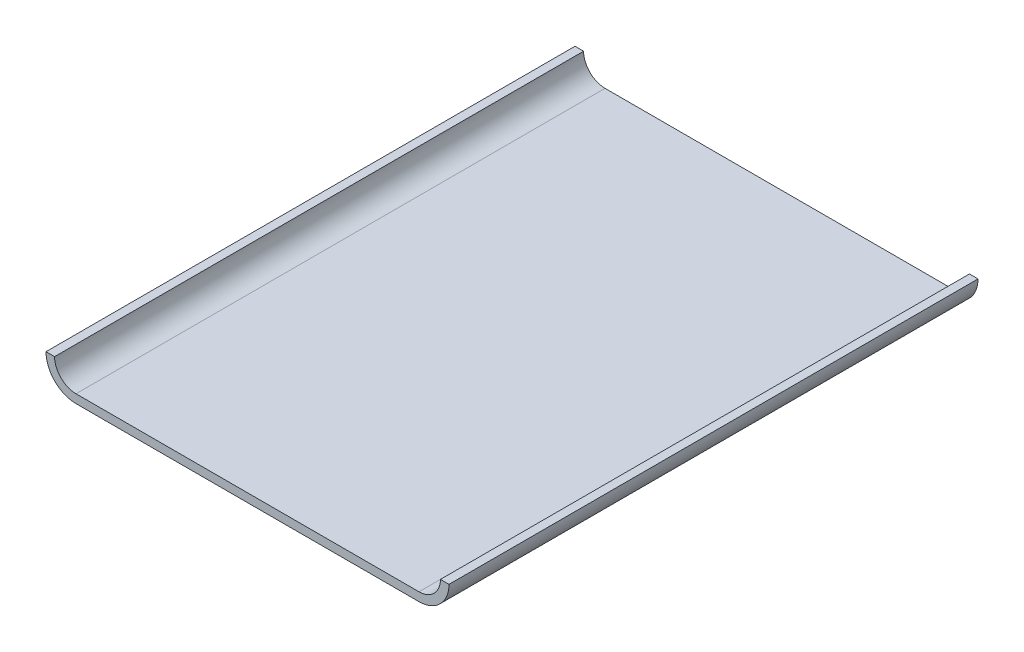
ISO-10303-21;
HEADER;
FILE_DESCRIPTION(('STEP AP214'),'2;1');
FILE_NAME('part.step','',(''),(''),'','','');
FILE_SCHEMA(('AUTOMOTIVE_DESIGN { 1 0 10303 214 1 1 1 1 }'));
ENDSEC;
DATA;
#1=APPLICATION_CONTEXT('core data for automotive mechanical design processes');
#2=APPLICATION_PROTOCOL_DEFINITION('international standard','automotive_design',2000,#1);
#3=PRODUCT_CONTEXT('',#1,'mechanical');
#4=PRODUCT('Part','Part','',(#3));
#5=PRODUCT_RELATED_PRODUCT_CATEGORY('part','',(#4));
#6=PRODUCT_DEFINITION_FORMATION('','',#4);
#7=PRODUCT_DEFINITION_CONTEXT('part definition',#1,'design');
#8=PRODUCT_DEFINITION('design','',#6,#7);
#9=PRODUCT_DEFINITION_SHAPE('','',#8);
#10=(LENGTH_UNIT() NAMED_UNIT(*) SI_UNIT(.MILLI.,.METRE.));
#11=(NAMED_UNIT(*) PLANE_ANGLE_UNIT() SI_UNIT($,.RADIAN.));
#12=(NAMED_UNIT(*) SI_UNIT($,.STERADIAN.) SOLID_ANGLE_UNIT());
#13=UNCERTAINTY_MEASURE_WITH_UNIT(LENGTH_MEASURE(1.E-05),#10,'distance_accuracy_value','');
#14=(GEOMETRIC_REPRESENTATION_CONTEXT(3) GLOBAL_UNCERTAINTY_ASSIGNED_CONTEXT((#13)) GLOBAL_UNIT_ASSIGNED_CONTEXT((#10,
#11,#12)) REPRESENTATION_CONTEXT('',''));
#15=CARTESIAN_POINT('',(0.,0.,0.));
#16=DIRECTION('',(0.,0.,1.));
#17=DIRECTION('',(1.,0.,0.));
#18=AXIS2_PLACEMENT_3D('',#15,#16,#17);
#19=CARTESIAN_POINT('',(0.,-77.851,0.));
#20=DIRECTION('',(0.,1.,0.));
#21=DIRECTION('',(0.,0.,1.));
#22=AXIS2_PLACEMENT_3D('',#19,#20,#21);
#23=PLANE('',#22);
#24=DIRECTION('',(0.,0.,-1.));
#25=VECTOR('',#24,1.);
#26=CARTESIAN_POINT('',(119.38,-77.851,156.718));
#27=LINE('',#26,#25);
#28=CARTESIAN_POINT('',(119.38,-77.851,156.718));
#29=VERTEX_POINT('',#28);
#30=CARTESIAN_POINT('',(119.38,-77.851,-156.718));
#31=VERTEX_POINT('',#30);
#32=EDGE_CURVE('E108',#29,#31,#27,.T.);
#33=ORIENTED_EDGE('',*,*,#32,.T.);
#34=DIRECTION('',(-1.,0.,0.));
#35=VECTOR('',#34,1.);
#36=CARTESIAN_POINT('',(101.6,-77.851,-156.718));
#37=LINE('',#36,#35);
#38=CARTESIAN_POINT('',(114.3,-77.851,-156.718));
#39=VERTEX_POINT('',#38);
#40=EDGE_CURVE('E105',#31,#39,#37,.T.);
#41=ORIENTED_EDGE('',*,*,#40,.T.);
#42=DIRECTION('',(0.,0.,-1.));
#43=VECTOR('',#42,1.);
#44=CARTESIAN_POINT('',(114.3,-77.851,156.718));
#45=LINE('',#44,#43);
#46=CARTESIAN_POINT('',(114.3,-77.851,156.718));
#47=VERTEX_POINT('',#46);
#48=EDGE_CURVE('E40',#47,#39,#45,.T.);
#49=ORIENTED_EDGE('',*,*,#48,.F.);
#50=DIRECTION('',(1.,0.,0.));
#51=VECTOR('',#50,1.);
#52=CARTESIAN_POINT('',(114.3,-77.851,156.718));
#53=LINE('',#52,#51);
#54=EDGE_CURVE('E122',#47,#29,#53,.T.);
#55=ORIENTED_EDGE('',*,*,#54,.T.);
#56=EDGE_LOOP('',(#33,#41,#49,#55));
#57=FACE_BOUND('',#56,.T.);
#58=ADVANCED_FACE('F36',(#57),#23,.T.);
#59=DIRECTION('',(0.,0.,-1.));
#60=VECTOR('',#59,1.);
#61=CARTESIAN_POINT('',(-119.38,-77.851,156.718));
#62=LINE('',#61,#60);
#63=CARTESIAN_POINT('',(-119.38,-77.851,156.718));
#64=VERTEX_POINT('',#63);
#65=CARTESIAN_POINT('',(-119.38,-77.851,-156.718));
#66=VERTEX_POINT('',#65);
#67=EDGE_CURVE('E75',#64,#66,#62,.T.);
#68=ORIENTED_EDGE('',*,*,#67,.F.);
#69=DIRECTION('',(1.,0.,0.));
#70=VECTOR('',#69,1.);
#71=CARTESIAN_POINT('',(-119.38,-77.851,156.718));
#72=LINE('',#71,#70);
#73=CARTESIAN_POINT('',(-114.3,-77.851,156.718));
#74=VERTEX_POINT('',#73);
#75=EDGE_CURVE('E124',#64,#74,#72,.T.);
#76=ORIENTED_EDGE('',*,*,#75,.T.);
#77=DIRECTION('',(0.,0.,-1.));
#78=VECTOR('',#77,1.);
#79=CARTESIAN_POINT('',(-114.3,-77.851,156.718));
#80=LINE('',#79,#78);
#81=CARTESIAN_POINT('',(-114.3,-77.851,-156.718));
#82=VERTEX_POINT('',#81);
#83=EDGE_CURVE('E127',#74,#82,#80,.T.);
#84=ORIENTED_EDGE('',*,*,#83,.T.);
#85=EDGE_CURVE('E111',#82,#66,#37,.T.);
#86=ORIENTED_EDGE('',*,*,#85,.T.);
#87=EDGE_LOOP('',(#68,#76,#84,#86));
#88=FACE_BOUND('',#87,.T.);
#89=ADVANCED_FACE('F183',(#88),#23,.T.);
#90=CARTESIAN_POINT('',(101.6,-77.851,-156.718));
#91=DIRECTION('',(0.,0.,1.));
#92=DIRECTION('',(1.,0.,0.));
#93=AXIS2_PLACEMENT_3D('',#90,#91,#92);
#94=PLANE('',#93);
#95=ORIENTED_EDGE('',*,*,#40,.F.);
#96=CARTESIAN_POINT('',(101.6,-77.851,-156.718));
#97=DIRECTION('',(0.,0.,1.));
#98=DIRECTION('',(1.,0.,0.));
#99=AXIS2_PLACEMENT_3D('',#96,#97,#98);
#100=CIRCLE('',#99,17.78);
#101=CARTESIAN_POINT('',(101.6,-95.631,-156.718));
#102=VERTEX_POINT('',#101);
#103=EDGE_CURVE('E148',#102,#31,#100,.T.);
#104=ORIENTED_EDGE('',*,*,#103,.F.);
#105=DIRECTION('',(1.,0.,0.));
#106=VECTOR('',#105,1.);
#107=CARTESIAN_POINT('',(-101.6,-95.631,-156.718));
#108=LINE('',#107,#106);
#109=CARTESIAN_POINT('',(-101.6,-95.631,-156.718));
#110=VERTEX_POINT('',#109);
#111=EDGE_CURVE('E143',#110,#102,#108,.T.);
#112=ORIENTED_EDGE('',*,*,#111,.F.);
#113=CARTESIAN_POINT('',(-101.6,-77.851,-156.718));
#114=DIRECTION('',(0.,0.,1.));
#115=DIRECTION('',(-1.,0.,0.));
#116=AXIS2_PLACEMENT_3D('',#113,#114,#115);
#117=CIRCLE('',#116,17.78);
#118=EDGE_CURVE('E145',#66,#110,#117,.T.);
#119=ORIENTED_EDGE('',*,*,#118,.F.);
#120=ORIENTED_EDGE('',*,*,#85,.F.);
#121=CARTESIAN_POINT('',(-101.6,-77.851,-156.718));
#122=DIRECTION('',(0.,0.,1.));
#123=DIRECTION('',(-1.,0.,0.));
#124=AXIS2_PLACEMENT_3D('',#121,#122,#123);
#125=CIRCLE('',#124,12.7);
#126=CARTESIAN_POINT('',(-101.6,-90.551,-156.718));
#127=VERTEX_POINT('',#126);
#128=EDGE_CURVE('E11',#82,#127,#125,.T.);
#129=ORIENTED_EDGE('',*,*,#128,.T.);
#130=DIRECTION('',(1.,0.,0.));
#131=VECTOR('',#130,1.);
#132=CARTESIAN_POINT('',(-101.6,-90.551,-156.718));
#133=LINE('',#132,#131);
#134=CARTESIAN_POINT('',(101.6,-90.551,-156.718));
#135=VERTEX_POINT('',#134);
#136=EDGE_CURVE('E46',#127,#135,#133,.T.);
#137=ORIENTED_EDGE('',*,*,#136,.T.);
#138=CARTESIAN_POINT('',(101.6,-77.851,-156.718));
#139=DIRECTION('',(0.,0.,1.));
#140=DIRECTION('',(1.,0.,0.));
#141=AXIS2_PLACEMENT_3D('',#138,#139,#140);
#142=CIRCLE('',#141,12.7);
#143=EDGE_CURVE('E95',#135,#39,#142,.T.);
#144=ORIENTED_EDGE('',*,*,#143,.T.);
#145=EDGE_LOOP('',(#95,#104,#112,#119,#120,#129,#137,#144));
#146=FACE_BOUND('',#145,.T.);
#147=ADVANCED_FACE('F38',(#146),#94,.F.);
#148=CARTESIAN_POINT('',(101.6,-77.851,156.718));
#149=DIRECTION('',(0.,0.,1.));
#150=DIRECTION('',(1.,0.,0.));
#151=AXIS2_PLACEMENT_3D('',#148,#149,#150);
#152=PLANE('',#151);
#153=ORIENTED_EDGE('',*,*,#54,.F.);
#154=CARTESIAN_POINT('',(101.6,-77.851,156.718));
#155=DIRECTION('',(0.,0.,1.));
#156=DIRECTION('',(1.,0.,0.));
#157=AXIS2_PLACEMENT_3D('',#154,#155,#156);
#158=CIRCLE('',#157,12.7);
#159=CARTESIAN_POINT('',(101.6,-90.551,156.718));
#160=VERTEX_POINT('',#159);
#161=EDGE_CURVE('E98',#160,#47,#158,.T.);
#162=ORIENTED_EDGE('',*,*,#161,.F.);
#163=DIRECTION('',(1.,0.,0.));
#164=VECTOR('',#163,1.);
#165=CARTESIAN_POINT('',(-101.6,-90.551,156.718));
#166=LINE('',#165,#164);
#167=CARTESIAN_POINT('',(-101.6,-90.551,156.718));
#168=VERTEX_POINT('',#167);
#169=EDGE_CURVE('E66',#168,#160,#166,.T.);
#170=ORIENTED_EDGE('',*,*,#169,.F.);
#171=CARTESIAN_POINT('',(-101.6,-77.851,156.718));
#172=DIRECTION('',(0.,0.,1.));
#173=DIRECTION('',(-1.,0.,0.));
#174=AXIS2_PLACEMENT_3D('',#171,#172,#173);
#175=CIRCLE('',#174,12.7);
#176=EDGE_CURVE('E113',#74,#168,#175,.T.);
#177=ORIENTED_EDGE('',*,*,#176,.F.);
#178=ORIENTED_EDGE('',*,*,#75,.F.);
#179=CARTESIAN_POINT('',(-101.6,-77.851,156.718));
#180=DIRECTION('',(0.,0.,1.));
#181=DIRECTION('',(-1.,0.,0.));
#182=AXIS2_PLACEMENT_3D('',#179,#180,#181);
#183=CIRCLE('',#182,17.78);
#184=CARTESIAN_POINT('',(-101.6,-95.631,156.718));
#185=VERTEX_POINT('',#184);
#186=EDGE_CURVE('E152',#64,#185,#183,.T.);
#187=ORIENTED_EDGE('',*,*,#186,.T.);
#188=DIRECTION('',(1.,0.,0.));
#189=VECTOR('',#188,1.);
#190=CARTESIAN_POINT('',(-101.6,-95.631,156.718));
#191=LINE('',#190,#189);
#192=CARTESIAN_POINT('',(101.6,-95.631,156.718));
#193=VERTEX_POINT('',#192);
#194=EDGE_CURVE('E140',#185,#193,#191,.T.);
#195=ORIENTED_EDGE('',*,*,#194,.T.);
#196=CARTESIAN_POINT('',(101.6,-77.851,156.718));
#197=DIRECTION('',(0.,0.,1.));
#198=DIRECTION('',(1.,0.,0.));
#199=AXIS2_PLACEMENT_3D('',#196,#197,#198);
#200=CIRCLE('',#199,17.78);
#201=EDGE_CURVE('E146',#193,#29,#200,.T.);
#202=ORIENTED_EDGE('',*,*,#201,.T.);
#203=EDGE_LOOP('',(#153,#162,#170,#177,#178,#187,#195,#202));
#204=FACE_BOUND('',#203,.T.);
#205=ADVANCED_FACE('F157',(#204),#152,.T.);
#206=CARTESIAN_POINT('',(101.6,-77.851,156.718));
#207=DIRECTION('',(0.,0.,-1.));
#208=DIRECTION('',(-1.,0.,0.));
#209=AXIS2_PLACEMENT_3D('',#206,#207,#208);
#210=CYLINDRICAL_SURFACE('',#209,17.78);
#211=ORIENTED_EDGE('',*,*,#103,.T.);
#212=ORIENTED_EDGE('',*,*,#32,.F.);
#213=ORIENTED_EDGE('',*,*,#201,.F.);
#214=DIRECTION('',(0.,0.,-1.));
#215=VECTOR('',#214,1.);
#216=CARTESIAN_POINT('',(101.6,-95.631,156.718));
#217=LINE('',#216,#215);
#218=EDGE_CURVE('E132',#193,#102,#217,.T.);
#219=ORIENTED_EDGE('',*,*,#218,.T.);
#220=EDGE_LOOP('',(#211,#212,#213,#219));
#221=FACE_BOUND('',#220,.T.);
#222=ADVANCED_FACE('F172',(#221),#210,.T.);
#223=CARTESIAN_POINT('',(-101.6,-77.851,156.718));
#224=DIRECTION('',(0.,0.,-1.));
#225=DIRECTION('',(-1.,0.,0.));
#226=AXIS2_PLACEMENT_3D('',#223,#224,#225);
#227=CYLINDRICAL_SURFACE('',#226,17.78);
#228=ORIENTED_EDGE('',*,*,#118,.T.);
#229=DIRECTION('',(0.,0.,-1.));
#230=VECTOR('',#229,1.);
#231=CARTESIAN_POINT('',(-101.6,-95.631,156.718));
#232=LINE('',#231,#230);
#233=EDGE_CURVE('E130',#185,#110,#232,.T.);
#234=ORIENTED_EDGE('',*,*,#233,.F.);
#235=ORIENTED_EDGE('',*,*,#186,.F.);
#236=ORIENTED_EDGE('',*,*,#67,.T.);
#237=EDGE_LOOP('',(#228,#234,#235,#236));
#238=FACE_BOUND('',#237,.T.);
#239=ADVANCED_FACE('F174',(#238),#227,.T.);
#240=CARTESIAN_POINT('',(-101.6,-95.631,156.718));
#241=DIRECTION('',(0.,1.,0.));
#242=DIRECTION('',(0.,0.,1.));
#243=AXIS2_PLACEMENT_3D('',#240,#241,#242);
#244=PLANE('',#243);
#245=ORIENTED_EDGE('',*,*,#111,.T.);
#246=ORIENTED_EDGE('',*,*,#218,.F.);
#247=ORIENTED_EDGE('',*,*,#194,.F.);
#248=ORIENTED_EDGE('',*,*,#233,.T.);
#249=EDGE_LOOP('',(#245,#246,#247,#248));
#250=FACE_BOUND('',#249,.T.);
#251=ADVANCED_FACE('F169',(#250),#244,.F.);
#252=CARTESIAN_POINT('',(-101.6,-77.851,156.718));
#253=DIRECTION('',(0.,0.,-1.));
#254=DIRECTION('',(-1.,0.,0.));
#255=AXIS2_PLACEMENT_3D('',#252,#253,#254);
#256=CYLINDRICAL_SURFACE('',#255,12.7);
#257=ORIENTED_EDGE('',*,*,#128,.F.);
#258=ORIENTED_EDGE('',*,*,#83,.F.);
#259=ORIENTED_EDGE('',*,*,#176,.T.);
#260=DIRECTION('',(0.,0.,-1.));
#261=VECTOR('',#260,1.);
#262=CARTESIAN_POINT('',(-101.6,-90.551,156.718));
#263=LINE('',#262,#261);
#264=EDGE_CURVE('E55',#168,#127,#263,.T.);
#265=ORIENTED_EDGE('',*,*,#264,.T.);
#266=EDGE_LOOP('',(#257,#258,#259,#265));
#267=FACE_BOUND('',#266,.T.);
#268=ADVANCED_FACE('F196',(#267),#256,.F.);
#269=CARTESIAN_POINT('',(-101.6,-90.551,156.718));
#270=DIRECTION('',(0.,1.,0.));
#271=DIRECTION('',(0.,0.,1.));
#272=AXIS2_PLACEMENT_3D('',#269,#270,#271);
#273=PLANE('',#272);
#274=ORIENTED_EDGE('',*,*,#136,.F.);
#275=ORIENTED_EDGE('',*,*,#264,.F.);
#276=ORIENTED_EDGE('',*,*,#169,.T.);
#277=DIRECTION('',(0.,0.,-1.));
#278=VECTOR('',#277,1.);
#279=CARTESIAN_POINT('',(101.6,-90.551,156.718));
#280=LINE('',#279,#278);
#281=EDGE_CURVE('E102',#160,#135,#280,.T.);
#282=ORIENTED_EDGE('',*,*,#281,.T.);
#283=EDGE_LOOP('',(#274,#275,#276,#282));
#284=FACE_BOUND('',#283,.T.);
#285=ADVANCED_FACE('F155',(#284),#273,.T.);
#286=CARTESIAN_POINT('',(101.6,-77.851,156.718));
#287=DIRECTION('',(0.,0.,-1.));
#288=DIRECTION('',(-1.,0.,0.));
#289=AXIS2_PLACEMENT_3D('',#286,#287,#288);
#290=CYLINDRICAL_SURFACE('',#289,12.7);
#291=ORIENTED_EDGE('',*,*,#143,.F.);
#292=ORIENTED_EDGE('',*,*,#281,.F.);
#293=ORIENTED_EDGE('',*,*,#161,.T.);
#294=ORIENTED_EDGE('',*,*,#48,.T.);
#295=EDGE_LOOP('',(#291,#292,#293,#294));
#296=FACE_BOUND('',#295,.T.);
#297=ADVANCED_FACE('F93',(#296),#290,.F.);
#298=CLOSED_SHELL('',(#58,#89,#147,#205,#222,#239,#251,#268,#285,#297));
#299=MANIFOLD_SOLID_BREP('B2',#298);
#300=ADVANCED_BREP_SHAPE_REPRESENTATION('',(#18,#299),#14);
#301=SHAPE_DEFINITION_REPRESENTATION(#9,#300);
ENDSEC;
END-ISO-10303-21;
